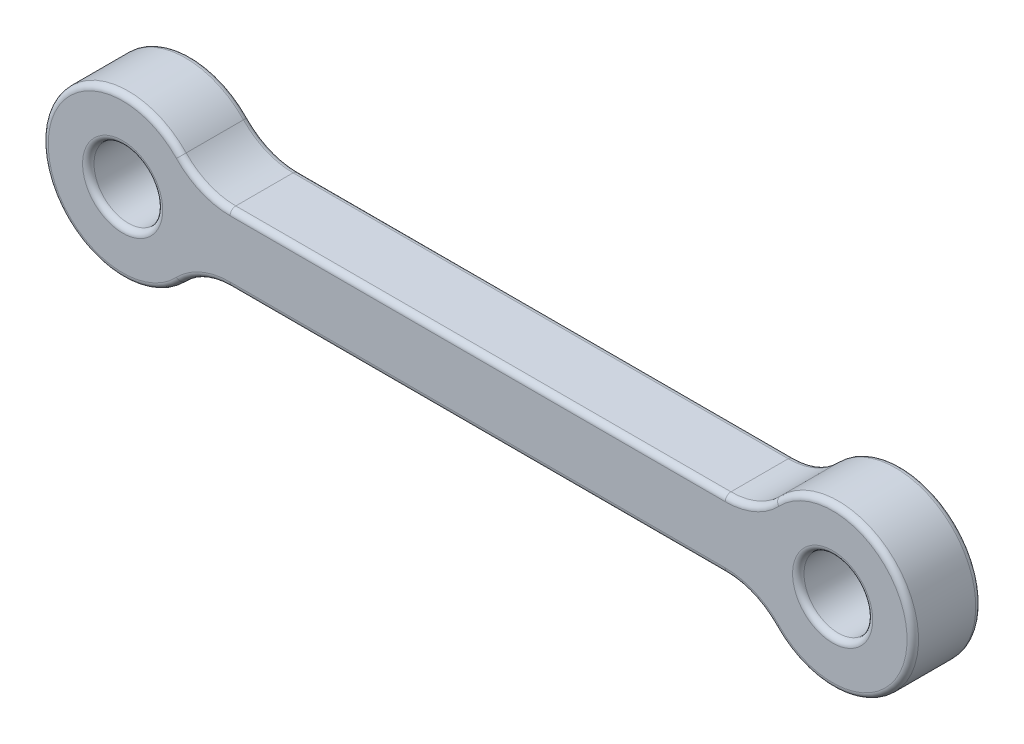
ISO-10303-21;
HEADER;
FILE_DESCRIPTION(('STEP AP214'),'2;1');
FILE_NAME('part.step','',(''),(''),'','','');
FILE_SCHEMA(('AUTOMOTIVE_DESIGN { 1 0 10303 214 1 1 1 1 }'));
ENDSEC;
DATA;
#1=APPLICATION_CONTEXT('core data for automotive mechanical design processes');
#2=APPLICATION_PROTOCOL_DEFINITION('international standard','automotive_design',2000,#1);
#3=PRODUCT_CONTEXT('',#1,'mechanical');
#4=PRODUCT('Part','Part','',(#3));
#5=PRODUCT_RELATED_PRODUCT_CATEGORY('part','',(#4));
#6=PRODUCT_DEFINITION_FORMATION('','',#4);
#7=PRODUCT_DEFINITION_CONTEXT('part definition',#1,'design');
#8=PRODUCT_DEFINITION('design','',#6,#7);
#9=PRODUCT_DEFINITION_SHAPE('','',#8);
#10=(LENGTH_UNIT() NAMED_UNIT(*) SI_UNIT(.MILLI.,.METRE.));
#11=(NAMED_UNIT(*) PLANE_ANGLE_UNIT() SI_UNIT($,.RADIAN.));
#12=(NAMED_UNIT(*) SI_UNIT($,.STERADIAN.) SOLID_ANGLE_UNIT());
#13=UNCERTAINTY_MEASURE_WITH_UNIT(LENGTH_MEASURE(1.E-05),#10,'distance_accuracy_value','');
#14=(GEOMETRIC_REPRESENTATION_CONTEXT(3) GLOBAL_UNCERTAINTY_ASSIGNED_CONTEXT((#13)) GLOBAL_UNIT_ASSIGNED_CONTEXT((#10,
#11,#12)) REPRESENTATION_CONTEXT('',''));
#15=CARTESIAN_POINT('',(0.,0.,0.));
#16=DIRECTION('',(0.,0.,1.));
#17=DIRECTION('',(1.,0.,0.));
#18=AXIS2_PLACEMENT_3D('',#15,#16,#17);
#19=CARTESIAN_POINT('',(0.,0.,1.5));
#20=DIRECTION('',(0.,0.,-1.));
#21=DIRECTION('',(-1.,0.,0.));
#22=AXIS2_PLACEMENT_3D('',#19,#20,#21);
#23=CYLINDRICAL_SURFACE('',#22,3.5);
#24=DIRECTION('',(0.,0.,-1.));
#25=VECTOR('',#24,1.);
#26=CARTESIAN_POINT('',(2.52560848605877,-2.42307692307692,1.5));
#27=LINE('',#26,#25);
#28=CARTESIAN_POINT('',(2.52560848605877,-2.42307692307692,-1.25));
#29=VERTEX_POINT('',#28);
#30=CARTESIAN_POINT('',(2.52560848605877,-2.42307692307692,1.25));
#31=VERTEX_POINT('',#30);
#32=EDGE_CURVE('E386',#29,#31,#27,.F.);
#33=ORIENTED_EDGE('',*,*,#32,.T.);
#34=CARTESIAN_POINT('',(0.,0.,1.25));
#35=DIRECTION('',(0.,0.,1.));
#36=DIRECTION('',(1.,0.,0.));
#37=AXIS2_PLACEMENT_3D('',#34,#35,#36);
#38=CIRCLE('',#37,3.5);
#39=CARTESIAN_POINT('',(2.52560848605877,2.42307692307692,1.25));
#40=VERTEX_POINT('',#39);
#41=EDGE_CURVE('E238',#31,#40,#38,.F.);
#42=ORIENTED_EDGE('',*,*,#41,.T.);
#43=DIRECTION('',(0.,0.,-1.));
#44=VECTOR('',#43,1.);
#45=CARTESIAN_POINT('',(2.52560848605877,2.42307692307692,1.5));
#46=LINE('',#45,#44);
#47=CARTESIAN_POINT('',(2.52560848605877,2.42307692307692,-1.25));
#48=VERTEX_POINT('',#47);
#49=EDGE_CURVE('E382',#40,#48,#46,.T.);
#50=ORIENTED_EDGE('',*,*,#49,.T.);
#51=CARTESIAN_POINT('',(0.,0.,-1.25));
#52=DIRECTION('',(0.,0.,1.));
#53=DIRECTION('',(1.,0.,0.));
#54=AXIS2_PLACEMENT_3D('',#51,#52,#53);
#55=CIRCLE('',#54,3.5);
#56=EDGE_CURVE('E235',#48,#29,#55,.T.);
#57=ORIENTED_EDGE('',*,*,#56,.T.);
#58=EDGE_LOOP('',(#33,#42,#50,#57));
#59=FACE_BOUND('',#58,.T.);
#60=ADVANCED_FACE('F41',(#59),#23,.T.);
#61=CARTESIAN_POINT('',(0.,-1.5,1.5));
#62=DIRECTION('',(0.,-1.,0.));
#63=DIRECTION('',(0.,0.,-1.));
#64=AXIS2_PLACEMENT_3D('',#61,#62,#63);
#65=PLANE('',#64);
#66=DIRECTION('',(0.,0.,1.));
#67=VECTOR('',#66,1.);
#68=CARTESIAN_POINT('',(26.3095842401766,-1.5,1.5));
#69=LINE('',#68,#67);
#70=CARTESIAN_POINT('',(26.3095842401766,-1.5,-1.25));
#71=VERTEX_POINT('',#70);
#72=CARTESIAN_POINT('',(26.3095842401766,-1.5,1.25));
#73=VERTEX_POINT('',#72);
#74=EDGE_CURVE('E378',#71,#73,#69,.T.);
#75=ORIENTED_EDGE('',*,*,#74,.T.);
#76=DIRECTION('',(-1.,0.,0.));
#77=VECTOR('',#76,1.);
#78=CARTESIAN_POINT('',(0.,-1.5,1.25));
#79=LINE('',#78,#77);
#80=CARTESIAN_POINT('',(4.69041575982343,-1.5,1.25));
#81=VERTEX_POINT('',#80);
#82=EDGE_CURVE('E225',#73,#81,#79,.T.);
#83=ORIENTED_EDGE('',*,*,#82,.T.);
#84=DIRECTION('',(0.,0.,-1.));
#85=VECTOR('',#84,1.);
#86=CARTESIAN_POINT('',(4.69041575982343,-1.5,1.5));
#87=LINE('',#86,#85);
#88=CARTESIAN_POINT('',(4.69041575982343,-1.5,-1.25));
#89=VERTEX_POINT('',#88);
#90=EDGE_CURVE('E374',#81,#89,#87,.T.);
#91=ORIENTED_EDGE('',*,*,#90,.T.);
#92=DIRECTION('',(-1.,0.,0.));
#93=VECTOR('',#92,1.);
#94=CARTESIAN_POINT('',(26.3095842401766,-1.5,-1.25));
#95=LINE('',#94,#93);
#96=EDGE_CURVE('E222',#89,#71,#95,.F.);
#97=ORIENTED_EDGE('',*,*,#96,.T.);
#98=EDGE_LOOP('',(#75,#83,#91,#97));
#99=FACE_BOUND('',#98,.T.);
#100=ADVANCED_FACE('F460',(#99),#65,.T.);
#101=CARTESIAN_POINT('',(31.,0.,1.5));
#102=DIRECTION('',(0.,0.,-1.));
#103=DIRECTION('',(-1.,0.,0.));
#104=AXIS2_PLACEMENT_3D('',#101,#102,#103);
#105=CYLINDRICAL_SURFACE('',#104,3.5);
#106=DIRECTION('',(0.,0.,-1.));
#107=VECTOR('',#106,1.);
#108=CARTESIAN_POINT('',(28.4743915139412,2.42307692307692,1.5));
#109=LINE('',#108,#107);
#110=CARTESIAN_POINT('',(28.4743915139412,2.42307692307692,-1.25));
#111=VERTEX_POINT('',#110);
#112=CARTESIAN_POINT('',(28.4743915139412,2.42307692307692,1.25));
#113=VERTEX_POINT('',#112);
#114=EDGE_CURVE('E358',#111,#113,#109,.F.);
#115=ORIENTED_EDGE('',*,*,#114,.T.);
#116=CARTESIAN_POINT('',(31.,0.,1.25));
#117=DIRECTION('',(0.,0.,1.));
#118=DIRECTION('',(1.,0.,0.));
#119=AXIS2_PLACEMENT_3D('',#116,#117,#118);
#120=CIRCLE('',#119,3.5);
#121=CARTESIAN_POINT('',(28.4743915139412,-2.42307692307692,1.25));
#122=VERTEX_POINT('',#121);
#123=EDGE_CURVE('E213',#113,#122,#120,.F.);
#124=ORIENTED_EDGE('',*,*,#123,.T.);
#125=DIRECTION('',(0.,0.,-1.));
#126=VECTOR('',#125,1.);
#127=CARTESIAN_POINT('',(28.4743915139412,-2.42307692307692,1.5));
#128=LINE('',#127,#126);
#129=CARTESIAN_POINT('',(28.4743915139412,-2.42307692307692,-1.25));
#130=VERTEX_POINT('',#129);
#131=EDGE_CURVE('E364',#122,#130,#128,.T.);
#132=ORIENTED_EDGE('',*,*,#131,.T.);
#133=CARTESIAN_POINT('',(31.,0.,-1.25));
#134=DIRECTION('',(0.,0.,1.));
#135=DIRECTION('',(1.,0.,0.));
#136=AXIS2_PLACEMENT_3D('',#133,#134,#135);
#137=CIRCLE('',#136,3.5);
#138=EDGE_CURVE('E210',#130,#111,#137,.T.);
#139=ORIENTED_EDGE('',*,*,#138,.T.);
#140=EDGE_LOOP('',(#115,#124,#132,#139));
#141=FACE_BOUND('',#140,.T.);
#142=ADVANCED_FACE('F416',(#141),#105,.T.);
#143=CARTESIAN_POINT('',(0.,1.5,1.5));
#144=DIRECTION('',(0.,-1.,0.));
#145=DIRECTION('',(0.,0.,-1.));
#146=AXIS2_PLACEMENT_3D('',#143,#144,#145);
#147=PLANE('',#146);
#148=DIRECTION('',(0.,0.,1.));
#149=VECTOR('',#148,1.);
#150=CARTESIAN_POINT('',(4.69041575982343,1.5,1.5));
#151=LINE('',#150,#149);
#152=CARTESIAN_POINT('',(4.69041575982343,1.5,-1.25));
#153=VERTEX_POINT('',#152);
#154=CARTESIAN_POINT('',(4.69041575982343,1.5,1.25));
#155=VERTEX_POINT('',#154);
#156=EDGE_CURVE('E310',#153,#155,#151,.T.);
#157=ORIENTED_EDGE('',*,*,#156,.T.);
#158=DIRECTION('',(-1.,0.,0.));
#159=VECTOR('',#158,1.);
#160=CARTESIAN_POINT('',(26.3095842401766,1.5,1.25));
#161=LINE('',#160,#159);
#162=CARTESIAN_POINT('',(26.3095842401766,1.5,1.25));
#163=VERTEX_POINT('',#162);
#164=EDGE_CURVE('E250',#155,#163,#161,.F.);
#165=ORIENTED_EDGE('',*,*,#164,.T.);
#166=DIRECTION('',(0.,0.,-1.));
#167=VECTOR('',#166,1.);
#168=CARTESIAN_POINT('',(26.3095842401766,1.5,1.5));
#169=LINE('',#168,#167);
#170=CARTESIAN_POINT('',(26.3095842401766,1.5,-1.25));
#171=VERTEX_POINT('',#170);
#172=EDGE_CURVE('E356',#163,#171,#169,.T.);
#173=ORIENTED_EDGE('',*,*,#172,.T.);
#174=DIRECTION('',(-1.,0.,0.));
#175=VECTOR('',#174,1.);
#176=CARTESIAN_POINT('',(0.,1.5,-1.25));
#177=LINE('',#176,#175);
#178=EDGE_CURVE('E247',#171,#153,#177,.T.);
#179=ORIENTED_EDGE('',*,*,#178,.T.);
#180=EDGE_LOOP('',(#157,#165,#173,#179));
#181=FACE_BOUND('',#180,.T.);
#182=ADVANCED_FACE('F361',(#181),#147,.F.);
#183=CARTESIAN_POINT('',(0.,0.,1.5));
#184=DIRECTION('',(0.,0.,-1.));
#185=DIRECTION('',(-1.,0.,0.));
#186=AXIS2_PLACEMENT_3D('',#183,#184,#185);
#187=CYLINDRICAL_SURFACE('',#186,1.5);
#188=CARTESIAN_POINT('',(0.,0.,1.25));
#189=DIRECTION('',(0.,0.,1.));
#190=DIRECTION('',(1.,0.,0.));
#191=AXIS2_PLACEMENT_3D('',#188,#189,#190);
#192=CIRCLE('',#191,1.5);
#193=CARTESIAN_POINT('',(1.5,0.,1.25));
#194=VERTEX_POINT('',#193);
#195=EDGE_CURVE('E257',#194,#194,#192,.T.);
#196=ORIENTED_EDGE('',*,*,#195,.T.);
#197=EDGE_LOOP('',(#196));
#198=FACE_BOUND('',#197,.T.);
#199=CARTESIAN_POINT('',(0.,0.,-1.25));
#200=DIRECTION('',(0.,0.,1.));
#201=DIRECTION('',(1.,0.,0.));
#202=AXIS2_PLACEMENT_3D('',#199,#200,#201);
#203=CIRCLE('',#202,1.5);
#204=CARTESIAN_POINT('',(1.5,0.,-1.25));
#205=VERTEX_POINT('',#204);
#206=EDGE_CURVE('E253',#205,#205,#203,.F.);
#207=ORIENTED_EDGE('',*,*,#206,.T.);
#208=EDGE_LOOP('',(#207));
#209=FACE_BOUND('',#208,.T.);
#210=ADVANCED_FACE('F471',(#198,#209),#187,.F.);
#211=CARTESIAN_POINT('',(31.,0.,1.5));
#212=DIRECTION('',(0.,0.,-1.));
#213=DIRECTION('',(-1.,0.,0.));
#214=AXIS2_PLACEMENT_3D('',#211,#212,#213);
#215=CYLINDRICAL_SURFACE('',#214,1.5);
#216=CARTESIAN_POINT('',(31.,0.,1.25));
#217=DIRECTION('',(0.,0.,1.));
#218=DIRECTION('',(1.,0.,0.));
#219=AXIS2_PLACEMENT_3D('',#216,#217,#218);
#220=CIRCLE('',#219,1.5);
#221=CARTESIAN_POINT('',(32.5,0.,1.25));
#222=VERTEX_POINT('',#221);
#223=EDGE_CURVE('E201',#222,#222,#220,.T.);
#224=ORIENTED_EDGE('',*,*,#223,.T.);
#225=EDGE_LOOP('',(#224));
#226=FACE_BOUND('',#225,.T.);
#227=CARTESIAN_POINT('',(31.,0.,-1.25));
#228=DIRECTION('',(0.,0.,1.));
#229=DIRECTION('',(1.,0.,0.));
#230=AXIS2_PLACEMENT_3D('',#227,#228,#229);
#231=CIRCLE('',#230,1.5);
#232=CARTESIAN_POINT('',(32.5,0.,-1.25));
#233=VERTEX_POINT('',#232);
#234=EDGE_CURVE('E192',#233,#233,#231,.F.);
#235=ORIENTED_EDGE('',*,*,#234,.T.);
#236=EDGE_LOOP('',(#235));
#237=FACE_BOUND('',#236,.T.);
#238=ADVANCED_FACE('F474',(#226,#237),#215,.F.);
#239=CARTESIAN_POINT('',(0.,0.,1.5));
#240=DIRECTION('',(0.,0.,1.));
#241=DIRECTION('',(1.,0.,0.));
#242=AXIS2_PLACEMENT_3D('',#239,#240,#241);
#243=PLANE('',#242);
#244=CARTESIAN_POINT('',(31.,0.,1.5));
#245=DIRECTION('',(0.,0.,1.));
#246=DIRECTION('',(1.,0.,0.));
#247=AXIS2_PLACEMENT_3D('',#244,#245,#246);
#248=CIRCLE('',#247,1.75);
#249=CARTESIAN_POINT('',(32.75,0.,1.5));
#250=VERTEX_POINT('',#249);
#251=EDGE_CURVE('E187',#250,#250,#248,.F.);
#252=ORIENTED_EDGE('',*,*,#251,.T.);
#253=EDGE_LOOP('',(#252));
#254=FACE_BOUND('',#253,.T.);
#255=CARTESIAN_POINT('',(31.,0.,1.5));
#256=DIRECTION('',(0.,0.,1.));
#257=DIRECTION('',(1.,0.,0.));
#258=AXIS2_PLACEMENT_3D('',#255,#256,#257);
#259=CIRCLE('',#258,3.25);
#260=CARTESIAN_POINT('',(28.6547921200883,-2.25,1.5));
#261=VERTEX_POINT('',#260);
#262=CARTESIAN_POINT('',(28.6547921200883,2.25,1.5));
#263=VERTEX_POINT('',#262);
#264=EDGE_CURVE('E184',#261,#263,#259,.T.);
#265=ORIENTED_EDGE('',*,*,#264,.T.);
#266=CARTESIAN_POINT('',(26.3095842401766,4.5,1.5));
#267=DIRECTION('',(0.,0.,1.));
#268=DIRECTION('',(1.,0.,0.));
#269=AXIS2_PLACEMENT_3D('',#266,#267,#268);
#270=CIRCLE('',#269,3.25);
#271=CARTESIAN_POINT('',(26.3095842401766,1.25,1.5));
#272=VERTEX_POINT('',#271);
#273=EDGE_CURVE('E162',#263,#272,#270,.F.);
#274=ORIENTED_EDGE('',*,*,#273,.T.);
#275=DIRECTION('',(-1.,0.,0.));
#276=VECTOR('',#275,1.);
#277=CARTESIAN_POINT('',(4.69041575982343,1.25,1.5));
#278=LINE('',#277,#276);
#279=CARTESIAN_POINT('',(4.69041575982343,1.25,1.5));
#280=VERTEX_POINT('',#279);
#281=EDGE_CURVE('E171',#272,#280,#278,.T.);
#282=ORIENTED_EDGE('',*,*,#281,.T.);
#283=CARTESIAN_POINT('',(4.69041575982343,4.5,1.5));
#284=DIRECTION('',(0.,0.,1.));
#285=DIRECTION('',(1.,0.,0.));
#286=AXIS2_PLACEMENT_3D('',#283,#284,#285);
#287=CIRCLE('',#286,3.25);
#288=CARTESIAN_POINT('',(2.34520787991171,2.25,1.5));
#289=VERTEX_POINT('',#288);
#290=EDGE_CURVE('E178',#280,#289,#287,.F.);
#291=ORIENTED_EDGE('',*,*,#290,.T.);
#292=CARTESIAN_POINT('',(0.,0.,1.5));
#293=DIRECTION('',(0.,0.,1.));
#294=DIRECTION('',(1.,0.,0.));
#295=AXIS2_PLACEMENT_3D('',#292,#293,#294);
#296=CIRCLE('',#295,3.25);
#297=CARTESIAN_POINT('',(2.34520787991171,-2.25,1.5));
#298=VERTEX_POINT('',#297);
#299=EDGE_CURVE('E395',#289,#298,#296,.T.);
#300=ORIENTED_EDGE('',*,*,#299,.T.);
#301=CARTESIAN_POINT('',(4.69041575982343,-4.5,1.5));
#302=DIRECTION('',(0.,0.,1.));
#303=DIRECTION('',(1.,0.,0.));
#304=AXIS2_PLACEMENT_3D('',#301,#302,#303);
#305=CIRCLE('',#304,3.25);
#306=CARTESIAN_POINT('',(4.69041575982343,-1.25,1.5));
#307=VERTEX_POINT('',#306);
#308=EDGE_CURVE('E398',#298,#307,#305,.F.);
#309=ORIENTED_EDGE('',*,*,#308,.T.);
#310=DIRECTION('',(-1.,0.,0.));
#311=VECTOR('',#310,1.);
#312=CARTESIAN_POINT('',(0.,-1.25,1.5));
#313=LINE('',#312,#311);
#314=CARTESIAN_POINT('',(26.3095842401766,-1.25,1.5));
#315=VERTEX_POINT('',#314);
#316=EDGE_CURVE('E401',#307,#315,#313,.F.);
#317=ORIENTED_EDGE('',*,*,#316,.T.);
#318=CARTESIAN_POINT('',(26.3095842401766,-4.5,1.5));
#319=DIRECTION('',(0.,0.,1.));
#320=DIRECTION('',(1.,0.,0.));
#321=AXIS2_PLACEMENT_3D('',#318,#319,#320);
#322=CIRCLE('',#321,3.25);
#323=EDGE_CURVE('E194',#315,#261,#322,.F.);
#324=ORIENTED_EDGE('',*,*,#323,.T.);
#325=EDGE_LOOP('',(#265,#274,#282,#291,#300,#309,#317,#324));
#326=FACE_BOUND('',#325,.T.);
#327=CARTESIAN_POINT('',(0.,0.,1.5));
#328=DIRECTION('',(0.,0.,1.));
#329=DIRECTION('',(1.,0.,0.));
#330=AXIS2_PLACEMENT_3D('',#327,#328,#329);
#331=CIRCLE('',#330,1.75);
#332=CARTESIAN_POINT('',(1.75,0.,1.5));
#333=VERTEX_POINT('',#332);
#334=EDGE_CURVE('E179',#333,#333,#331,.F.);
#335=ORIENTED_EDGE('',*,*,#334,.T.);
#336=EDGE_LOOP('',(#335));
#337=FACE_BOUND('',#336,.T.);
#338=ADVANCED_FACE('F181',(#254,#326,#337),#243,.T.);
#339=CARTESIAN_POINT('',(0.,0.,-1.5));
#340=DIRECTION('',(0.,0.,1.));
#341=DIRECTION('',(1.,0.,0.));
#342=AXIS2_PLACEMENT_3D('',#339,#340,#341);
#343=PLANE('',#342);
#344=CARTESIAN_POINT('',(31.,0.,-1.5));
#345=DIRECTION('',(0.,0.,1.));
#346=DIRECTION('',(1.,0.,0.));
#347=AXIS2_PLACEMENT_3D('',#344,#345,#346);
#348=CIRCLE('',#347,1.75);
#349=CARTESIAN_POINT('',(32.75,0.,-1.5));
#350=VERTEX_POINT('',#349);
#351=EDGE_CURVE('E11',#350,#350,#348,.T.);
#352=ORIENTED_EDGE('',*,*,#351,.T.);
#353=EDGE_LOOP('',(#352));
#354=FACE_BOUND('',#353,.T.);
#355=DIRECTION('',(-1.,0.,0.));
#356=VECTOR('',#355,1.);
#357=CARTESIAN_POINT('',(4.69041575982343,-1.25,-1.5));
#358=LINE('',#357,#356);
#359=CARTESIAN_POINT('',(26.3095842401766,-1.25,-1.5));
#360=VERTEX_POINT('',#359);
#361=CARTESIAN_POINT('',(4.69041575982343,-1.25,-1.5));
#362=VERTEX_POINT('',#361);
#363=EDGE_CURVE('E59',#360,#362,#358,.T.);
#364=ORIENTED_EDGE('',*,*,#363,.T.);
#365=CARTESIAN_POINT('',(4.69041575982343,-4.5,-1.5));
#366=DIRECTION('',(0.,0.,1.));
#367=DIRECTION('',(1.,0.,0.));
#368=AXIS2_PLACEMENT_3D('',#365,#366,#367);
#369=CIRCLE('',#368,3.25);
#370=CARTESIAN_POINT('',(2.34520787991171,-2.25,-1.5));
#371=VERTEX_POINT('',#370);
#372=EDGE_CURVE('E51',#362,#371,#369,.T.);
#373=ORIENTED_EDGE('',*,*,#372,.T.);
#374=CARTESIAN_POINT('',(0.,0.,-1.5));
#375=DIRECTION('',(0.,0.,1.));
#376=DIRECTION('',(1.,0.,0.));
#377=AXIS2_PLACEMENT_3D('',#374,#375,#376);
#378=CIRCLE('',#377,3.25);
#379=CARTESIAN_POINT('',(2.34520787991171,2.25,-1.5));
#380=VERTEX_POINT('',#379);
#381=EDGE_CURVE('E265',#371,#380,#378,.F.);
#382=ORIENTED_EDGE('',*,*,#381,.T.);
#383=CARTESIAN_POINT('',(4.69041575982343,4.5,-1.5));
#384=DIRECTION('',(0.,0.,1.));
#385=DIRECTION('',(1.,0.,0.));
#386=AXIS2_PLACEMENT_3D('',#383,#384,#385);
#387=CIRCLE('',#386,3.25);
#388=CARTESIAN_POINT('',(4.69041575982343,1.25,-1.5));
#389=VERTEX_POINT('',#388);
#390=EDGE_CURVE('E268',#380,#389,#387,.T.);
#391=ORIENTED_EDGE('',*,*,#390,.T.);
#392=DIRECTION('',(-1.,0.,0.));
#393=VECTOR('',#392,1.);
#394=CARTESIAN_POINT('',(0.,1.25,-1.5));
#395=LINE('',#394,#393);
#396=CARTESIAN_POINT('',(26.3095842401766,1.25,-1.5));
#397=VERTEX_POINT('',#396);
#398=EDGE_CURVE('E271',#389,#397,#395,.F.);
#399=ORIENTED_EDGE('',*,*,#398,.T.);
#400=CARTESIAN_POINT('',(26.3095842401766,4.5,-1.5));
#401=DIRECTION('',(0.,0.,1.));
#402=DIRECTION('',(1.,0.,0.));
#403=AXIS2_PLACEMENT_3D('',#400,#401,#402);
#404=CIRCLE('',#403,3.25);
#405=CARTESIAN_POINT('',(28.6547921200883,2.25,-1.5));
#406=VERTEX_POINT('',#405);
#407=EDGE_CURVE('E274',#397,#406,#404,.T.);
#408=ORIENTED_EDGE('',*,*,#407,.T.);
#409=CARTESIAN_POINT('',(31.,0.,-1.5));
#410=DIRECTION('',(0.,0.,1.));
#411=DIRECTION('',(1.,0.,0.));
#412=AXIS2_PLACEMENT_3D('',#409,#410,#411);
#413=CIRCLE('',#412,3.25);
#414=CARTESIAN_POINT('',(28.6547921200883,-2.25,-1.5));
#415=VERTEX_POINT('',#414);
#416=EDGE_CURVE('E277',#406,#415,#413,.F.);
#417=ORIENTED_EDGE('',*,*,#416,.T.);
#418=CARTESIAN_POINT('',(26.3095842401766,-4.5,-1.5));
#419=DIRECTION('',(0.,0.,1.));
#420=DIRECTION('',(1.,0.,0.));
#421=AXIS2_PLACEMENT_3D('',#418,#419,#420);
#422=CIRCLE('',#421,3.25);
#423=EDGE_CURVE('E64',#415,#360,#422,.T.);
#424=ORIENTED_EDGE('',*,*,#423,.T.);
#425=EDGE_LOOP('',(#364,#373,#382,#391,#399,#408,#417,#424));
#426=FACE_BOUND('',#425,.T.);
#427=CARTESIAN_POINT('',(0.,0.,-1.5));
#428=DIRECTION('',(0.,0.,1.));
#429=DIRECTION('',(1.,0.,0.));
#430=AXIS2_PLACEMENT_3D('',#427,#428,#429);
#431=CIRCLE('',#430,1.75);
#432=CARTESIAN_POINT('',(1.75,0.,-1.5));
#433=VERTEX_POINT('',#432);
#434=EDGE_CURVE('E261',#433,#433,#431,.T.);
#435=ORIENTED_EDGE('',*,*,#434,.T.);
#436=EDGE_LOOP('',(#435));
#437=FACE_BOUND('',#436,.T.);
#438=ADVANCED_FACE('F432',(#354,#426,#437),#343,.F.);
#439=CARTESIAN_POINT('',(26.3095842401766,4.5,1.5));
#440=DIRECTION('',(0.,0.,-1.));
#441=DIRECTION('',(-1.,0.,0.));
#442=AXIS2_PLACEMENT_3D('',#439,#440,#441);
#443=CYLINDRICAL_SURFACE('',#442,3.);
#444=ORIENTED_EDGE('',*,*,#172,.F.);
#445=CARTESIAN_POINT('',(26.3095842401766,4.5,1.25));
#446=DIRECTION('',(0.,0.,1.));
#447=DIRECTION('',(1.,0.,0.));
#448=AXIS2_PLACEMENT_3D('',#445,#446,#447);
#449=CIRCLE('',#448,3.);
#450=EDGE_CURVE('E164',#163,#113,#449,.T.);
#451=ORIENTED_EDGE('',*,*,#450,.T.);
#452=ORIENTED_EDGE('',*,*,#114,.F.);
#453=CARTESIAN_POINT('',(26.3095842401766,4.5,-1.25));
#454=DIRECTION('',(0.,0.,1.));
#455=DIRECTION('',(1.,0.,0.));
#456=AXIS2_PLACEMENT_3D('',#453,#454,#455);
#457=CIRCLE('',#456,3.);
#458=EDGE_CURVE('E205',#111,#171,#457,.F.);
#459=ORIENTED_EDGE('',*,*,#458,.T.);
#460=EDGE_LOOP('',(#444,#451,#452,#459));
#461=FACE_BOUND('',#460,.T.);
#462=ADVANCED_FACE('F355',(#461),#443,.F.);
#463=CARTESIAN_POINT('',(26.3095842401766,-4.5,1.5));
#464=DIRECTION('',(0.,0.,-1.));
#465=DIRECTION('',(-1.,0.,0.));
#466=AXIS2_PLACEMENT_3D('',#463,#464,#465);
#467=CYLINDRICAL_SURFACE('',#466,3.);
#468=ORIENTED_EDGE('',*,*,#131,.F.);
#469=CARTESIAN_POINT('',(26.3095842401766,-4.5,1.25));
#470=DIRECTION('',(0.,0.,1.));
#471=DIRECTION('',(1.,0.,0.));
#472=AXIS2_PLACEMENT_3D('',#469,#470,#471);
#473=CIRCLE('',#472,3.);
#474=EDGE_CURVE('E219',#122,#73,#473,.T.);
#475=ORIENTED_EDGE('',*,*,#474,.T.);
#476=ORIENTED_EDGE('',*,*,#74,.F.);
#477=CARTESIAN_POINT('',(26.3095842401766,-4.5,-1.25));
#478=DIRECTION('',(0.,0.,1.));
#479=DIRECTION('',(1.,0.,0.));
#480=AXIS2_PLACEMENT_3D('',#477,#478,#479);
#481=CIRCLE('',#480,3.);
#482=EDGE_CURVE('E216',#71,#130,#481,.F.);
#483=ORIENTED_EDGE('',*,*,#482,.T.);
#484=EDGE_LOOP('',(#468,#475,#476,#483));
#485=FACE_BOUND('',#484,.T.);
#486=ADVANCED_FACE('F418',(#485),#467,.F.);
#487=CARTESIAN_POINT('',(4.69041575982343,-4.5,1.5));
#488=DIRECTION('',(0.,0.,-1.));
#489=DIRECTION('',(-1.,0.,0.));
#490=AXIS2_PLACEMENT_3D('',#487,#488,#489);
#491=CYLINDRICAL_SURFACE('',#490,3.);
#492=ORIENTED_EDGE('',*,*,#90,.F.);
#493=CARTESIAN_POINT('',(4.69041575982343,-4.5,1.25));
#494=DIRECTION('',(0.,0.,1.));
#495=DIRECTION('',(1.,0.,0.));
#496=AXIS2_PLACEMENT_3D('',#493,#494,#495);
#497=CIRCLE('',#496,3.);
#498=EDGE_CURVE('E232',#81,#31,#497,.T.);
#499=ORIENTED_EDGE('',*,*,#498,.T.);
#500=ORIENTED_EDGE('',*,*,#32,.F.);
#501=CARTESIAN_POINT('',(4.69041575982343,-4.5,-1.25));
#502=DIRECTION('',(0.,0.,1.));
#503=DIRECTION('',(1.,0.,0.));
#504=AXIS2_PLACEMENT_3D('',#501,#502,#503);
#505=CIRCLE('',#504,3.);
#506=EDGE_CURVE('E228',#29,#89,#505,.F.);
#507=ORIENTED_EDGE('',*,*,#506,.T.);
#508=EDGE_LOOP('',(#492,#499,#500,#507));
#509=FACE_BOUND('',#508,.T.);
#510=ADVANCED_FACE('F449',(#509),#491,.F.);
#511=CARTESIAN_POINT('',(4.69041575982343,4.5,1.5));
#512=DIRECTION('',(0.,0.,-1.));
#513=DIRECTION('',(-1.,0.,0.));
#514=AXIS2_PLACEMENT_3D('',#511,#512,#513);
#515=CYLINDRICAL_SURFACE('',#514,3.);
#516=ORIENTED_EDGE('',*,*,#49,.F.);
#517=CARTESIAN_POINT('',(4.69041575982343,4.5,1.25));
#518=DIRECTION('',(0.,0.,1.));
#519=DIRECTION('',(1.,0.,0.));
#520=AXIS2_PLACEMENT_3D('',#517,#518,#519);
#521=CIRCLE('',#520,3.);
#522=EDGE_CURVE('E244',#40,#155,#521,.T.);
#523=ORIENTED_EDGE('',*,*,#522,.T.);
#524=ORIENTED_EDGE('',*,*,#156,.F.);
#525=CARTESIAN_POINT('',(4.69041575982343,4.5,-1.25));
#526=DIRECTION('',(0.,0.,1.));
#527=DIRECTION('',(1.,0.,0.));
#528=AXIS2_PLACEMENT_3D('',#525,#526,#527);
#529=CIRCLE('',#528,3.);
#530=EDGE_CURVE('E241',#153,#48,#529,.F.);
#531=ORIENTED_EDGE('',*,*,#530,.T.);
#532=EDGE_LOOP('',(#516,#523,#524,#531));
#533=FACE_BOUND('',#532,.T.);
#534=ADVANCED_FACE('F482',(#533),#515,.F.);
#535=CARTESIAN_POINT('',(31.,0.,1.25));
#536=DIRECTION('',(0.,0.,1.));
#537=DIRECTION('',(1.,0.,0.));
#538=AXIS2_PLACEMENT_3D('',#535,#536,#537);
#539=TOROIDAL_SURFACE('',#538,1.75,0.25);
#540=ORIENTED_EDGE('',*,*,#223,.F.);
#541=EDGE_LOOP('',(#540));
#542=FACE_BOUND('',#541,.T.);
#543=ORIENTED_EDGE('',*,*,#251,.F.);
#544=EDGE_LOOP('',(#543));
#545=FACE_BOUND('',#544,.T.);
#546=ADVANCED_FACE('F485',(#542,#545),#539,.T.);
#547=CARTESIAN_POINT('',(4.69041575982343,-4.5,1.25));
#548=DIRECTION('',(0.,0.,1.));
#549=DIRECTION('',(1.,0.,0.));
#550=AXIS2_PLACEMENT_3D('',#547,#548,#549);
#551=TOROIDAL_SURFACE('',#550,3.25,0.25);
#552=CARTESIAN_POINT('',(2.34520787991171,-2.25,1.25));
#553=DIRECTION('',(-0.692307692307692,-0.72160242458822,0.));
#554=DIRECTION('',(0.72160242458822,-0.692307692307692,0.));
#555=AXIS2_PLACEMENT_3D('',#552,#553,#554);
#556=CIRCLE('',#555,0.25);
#557=EDGE_CURVE('E302',#31,#298,#556,.T.);
#558=ORIENTED_EDGE('',*,*,#557,.F.);
#559=ORIENTED_EDGE('',*,*,#498,.F.);
#560=CARTESIAN_POINT('',(4.69041575982343,-1.25,1.25));
#561=DIRECTION('',(1.,0.,0.));
#562=DIRECTION('',(0.,0.,-1.));
#563=AXIS2_PLACEMENT_3D('',#560,#561,#562);
#564=CIRCLE('',#563,0.25);
#565=EDGE_CURVE('E306',#307,#81,#564,.T.);
#566=ORIENTED_EDGE('',*,*,#565,.F.);
#567=ORIENTED_EDGE('',*,*,#308,.F.);
#568=EDGE_LOOP('',(#558,#559,#566,#567));
#569=FACE_BOUND('',#568,.T.);
#570=ADVANCED_FACE('F453',(#569),#551,.T.);
#571=CARTESIAN_POINT('',(0.,-1.25,1.25));
#572=DIRECTION('',(-1.,0.,0.));
#573=DIRECTION('',(0.,0.,1.));
#574=AXIS2_PLACEMENT_3D('',#571,#572,#573);
#575=CYLINDRICAL_SURFACE('',#574,0.25);
#576=ORIENTED_EDGE('',*,*,#565,.T.);
#577=ORIENTED_EDGE('',*,*,#82,.F.);
#578=CARTESIAN_POINT('',(26.3095842401766,-1.25,1.25));
#579=DIRECTION('',(1.,0.,0.));
#580=DIRECTION('',(0.,0.,-1.));
#581=AXIS2_PLACEMENT_3D('',#578,#579,#580);
#582=CIRCLE('',#581,0.25);
#583=EDGE_CURVE('E298',#315,#73,#582,.T.);
#584=ORIENTED_EDGE('',*,*,#583,.F.);
#585=ORIENTED_EDGE('',*,*,#316,.F.);
#586=EDGE_LOOP('',(#576,#577,#584,#585));
#587=FACE_BOUND('',#586,.T.);
#588=ADVANCED_FACE('F458',(#587),#575,.T.);
#589=CARTESIAN_POINT('',(0.,0.,1.25));
#590=DIRECTION('',(0.,0.,1.));
#591=DIRECTION('',(1.,0.,0.));
#592=AXIS2_PLACEMENT_3D('',#589,#590,#591);
#593=TOROIDAL_SURFACE('',#592,3.25,0.25);
#594=ORIENTED_EDGE('',*,*,#557,.T.);
#595=ORIENTED_EDGE('',*,*,#299,.F.);
#596=CARTESIAN_POINT('',(2.34520787991171,2.25,1.25));
#597=DIRECTION('',(0.692307692307692,-0.72160242458822,0.));
#598=DIRECTION('',(0.72160242458822,0.692307692307692,0.));
#599=AXIS2_PLACEMENT_3D('',#596,#597,#598);
#600=CIRCLE('',#599,0.25);
#601=EDGE_CURVE('E294',#40,#289,#600,.T.);
#602=ORIENTED_EDGE('',*,*,#601,.F.);
#603=ORIENTED_EDGE('',*,*,#41,.F.);
#604=EDGE_LOOP('',(#594,#595,#602,#603));
#605=FACE_BOUND('',#604,.T.);
#606=ADVANCED_FACE('F503',(#605),#593,.T.);
#607=CARTESIAN_POINT('',(26.3095842401766,-4.5,1.25));
#608=DIRECTION('',(0.,0.,1.));
#609=DIRECTION('',(1.,0.,0.));
#610=AXIS2_PLACEMENT_3D('',#607,#608,#609);
#611=TOROIDAL_SURFACE('',#610,3.25,0.25);
#612=ORIENTED_EDGE('',*,*,#583,.T.);
#613=ORIENTED_EDGE('',*,*,#474,.F.);
#614=CARTESIAN_POINT('',(28.6547921200883,-2.25,1.25));
#615=DIRECTION('',(0.692307692307699,-0.721602424588214,0.));
#616=DIRECTION('',(0.721602424588214,0.692307692307699,0.));
#617=AXIS2_PLACEMENT_3D('',#614,#615,#616);
#618=CIRCLE('',#617,0.25);
#619=EDGE_CURVE('E290',#261,#122,#618,.T.);
#620=ORIENTED_EDGE('',*,*,#619,.F.);
#621=ORIENTED_EDGE('',*,*,#323,.F.);
#622=EDGE_LOOP('',(#612,#613,#620,#621));
#623=FACE_BOUND('',#622,.T.);
#624=ADVANCED_FACE('F410',(#623),#611,.T.);
#625=CARTESIAN_POINT('',(4.69041575982343,4.5,1.25));
#626=DIRECTION('',(0.,0.,1.));
#627=DIRECTION('',(1.,0.,0.));
#628=AXIS2_PLACEMENT_3D('',#625,#626,#627);
#629=TOROIDAL_SURFACE('',#628,3.25,0.25);
#630=ORIENTED_EDGE('',*,*,#601,.T.);
#631=ORIENTED_EDGE('',*,*,#290,.F.);
#632=CARTESIAN_POINT('',(4.69041575982343,1.25,1.25));
#633=DIRECTION('',(1.,0.,0.));
#634=DIRECTION('',(0.,0.,-1.));
#635=AXIS2_PLACEMENT_3D('',#632,#633,#634);
#636=CIRCLE('',#635,0.25);
#637=EDGE_CURVE('E174',#155,#280,#636,.T.);
#638=ORIENTED_EDGE('',*,*,#637,.F.);
#639=ORIENTED_EDGE('',*,*,#522,.F.);
#640=EDGE_LOOP('',(#630,#631,#638,#639));
#641=FACE_BOUND('',#640,.T.);
#642=ADVANCED_FACE('F497',(#641),#629,.T.);
#643=CARTESIAN_POINT('',(31.,0.,1.25));
#644=DIRECTION('',(0.,0.,1.));
#645=DIRECTION('',(1.,0.,0.));
#646=AXIS2_PLACEMENT_3D('',#643,#644,#645);
#647=TOROIDAL_SURFACE('',#646,3.25,0.25);
#648=ORIENTED_EDGE('',*,*,#619,.T.);
#649=ORIENTED_EDGE('',*,*,#123,.F.);
#650=CARTESIAN_POINT('',(28.6547921200883,2.25,1.25));
#651=DIRECTION('',(-0.692307692307698,-0.721602424588214,0.));
#652=DIRECTION('',(0.721602424588215,-0.692307692307698,0.));
#653=AXIS2_PLACEMENT_3D('',#650,#651,#652);
#654=CIRCLE('',#653,0.25);
#655=EDGE_CURVE('E168',#263,#113,#654,.T.);
#656=ORIENTED_EDGE('',*,*,#655,.F.);
#657=ORIENTED_EDGE('',*,*,#264,.F.);
#658=EDGE_LOOP('',(#648,#649,#656,#657));
#659=FACE_BOUND('',#658,.T.);
#660=ADVANCED_FACE('F413',(#659),#647,.T.);
#661=CARTESIAN_POINT('',(0.,1.25,1.25));
#662=DIRECTION('',(1.,0.,0.));
#663=DIRECTION('',(0.,0.,-1.));
#664=AXIS2_PLACEMENT_3D('',#661,#662,#663);
#665=CYLINDRICAL_SURFACE('',#664,0.25);
#666=ORIENTED_EDGE('',*,*,#637,.T.);
#667=ORIENTED_EDGE('',*,*,#281,.F.);
#668=CARTESIAN_POINT('',(26.3095842401766,1.25,1.25));
#669=DIRECTION('',(1.,0.,0.));
#670=DIRECTION('',(0.,0.,-1.));
#671=AXIS2_PLACEMENT_3D('',#668,#669,#670);
#672=CIRCLE('',#671,0.25);
#673=EDGE_CURVE('E158',#163,#272,#672,.T.);
#674=ORIENTED_EDGE('',*,*,#673,.F.);
#675=ORIENTED_EDGE('',*,*,#164,.F.);
#676=EDGE_LOOP('',(#666,#667,#674,#675));
#677=FACE_BOUND('',#676,.T.);
#678=ADVANCED_FACE('F172',(#677),#665,.T.);
#679=CARTESIAN_POINT('',(26.3095842401766,4.5,1.25));
#680=DIRECTION('',(0.,0.,1.));
#681=DIRECTION('',(1.,0.,0.));
#682=AXIS2_PLACEMENT_3D('',#679,#680,#681);
#683=TOROIDAL_SURFACE('',#682,3.25,0.25);
#684=ORIENTED_EDGE('',*,*,#655,.T.);
#685=ORIENTED_EDGE('',*,*,#450,.F.);
#686=ORIENTED_EDGE('',*,*,#673,.T.);
#687=ORIENTED_EDGE('',*,*,#273,.F.);
#688=EDGE_LOOP('',(#684,#685,#686,#687));
#689=FACE_BOUND('',#688,.T.);
#690=ADVANCED_FACE('F160',(#689),#683,.T.);
#691=CARTESIAN_POINT('',(0.,0.,1.25));
#692=DIRECTION('',(0.,0.,1.));
#693=DIRECTION('',(1.,0.,0.));
#694=AXIS2_PLACEMENT_3D('',#691,#692,#693);
#695=TOROIDAL_SURFACE('',#694,1.75,0.25);
#696=ORIENTED_EDGE('',*,*,#334,.F.);
#697=EDGE_LOOP('',(#696));
#698=FACE_BOUND('',#697,.T.);
#699=ORIENTED_EDGE('',*,*,#195,.F.);
#700=EDGE_LOOP('',(#699));
#701=FACE_BOUND('',#700,.T.);
#702=ADVANCED_FACE('F492',(#698,#701),#695,.T.);
#703=CARTESIAN_POINT('',(31.,0.,-1.25));
#704=DIRECTION('',(0.,0.,1.));
#705=DIRECTION('',(1.,0.,0.));
#706=AXIS2_PLACEMENT_3D('',#703,#704,#705);
#707=TOROIDAL_SURFACE('',#706,1.75,0.25);
#708=ORIENTED_EDGE('',*,*,#351,.F.);
#709=EDGE_LOOP('',(#708));
#710=FACE_BOUND('',#709,.T.);
#711=ORIENTED_EDGE('',*,*,#234,.F.);
#712=EDGE_LOOP('',(#711));
#713=FACE_BOUND('',#712,.T.);
#714=ADVANCED_FACE('F513',(#710,#713),#707,.T.);
#715=CARTESIAN_POINT('',(26.3095842401766,4.5,-1.25));
#716=DIRECTION('',(0.,0.,1.));
#717=DIRECTION('',(1.,0.,0.));
#718=AXIS2_PLACEMENT_3D('',#715,#716,#717);
#719=TOROIDAL_SURFACE('',#718,3.25,0.25);
#720=CARTESIAN_POINT('',(26.3095842401766,1.25,-1.25));
#721=DIRECTION('',(-1.,0.,0.));
#722=DIRECTION('',(0.,0.,1.));
#723=AXIS2_PLACEMENT_3D('',#720,#721,#722);
#724=CIRCLE('',#723,0.25);
#725=EDGE_CURVE('E332',#171,#397,#724,.T.);
#726=ORIENTED_EDGE('',*,*,#725,.F.);
#727=ORIENTED_EDGE('',*,*,#458,.F.);
#728=CARTESIAN_POINT('',(28.6547921200883,2.25,-1.25));
#729=DIRECTION('',(0.692307692307699,0.721602424588214,0.));
#730=DIRECTION('',(-0.721602424588214,0.692307692307699,0.));
#731=AXIS2_PLACEMENT_3D('',#728,#729,#730);
#732=CIRCLE('',#731,0.25);
#733=EDGE_CURVE('E45',#406,#111,#732,.T.);
#734=ORIENTED_EDGE('',*,*,#733,.F.);
#735=ORIENTED_EDGE('',*,*,#407,.F.);
#736=EDGE_LOOP('',(#726,#727,#734,#735));
#737=FACE_BOUND('',#736,.T.);
#738=ADVANCED_FACE('F350',(#737),#719,.T.);
#739=CARTESIAN_POINT('',(31.,0.,-1.25));
#740=DIRECTION('',(0.,0.,1.));
#741=DIRECTION('',(1.,0.,0.));
#742=AXIS2_PLACEMENT_3D('',#739,#740,#741);
#743=TOROIDAL_SURFACE('',#742,3.25,0.25);
#744=ORIENTED_EDGE('',*,*,#733,.T.);
#745=ORIENTED_EDGE('',*,*,#138,.F.);
#746=CARTESIAN_POINT('',(28.6547921200883,-2.25,-1.25));
#747=DIRECTION('',(-0.692307692307698,0.721602424588214,0.));
#748=DIRECTION('',(-0.721602424588215,-0.692307692307698,0.));
#749=AXIS2_PLACEMENT_3D('',#746,#747,#748);
#750=CIRCLE('',#749,0.25);
#751=EDGE_CURVE('E329',#415,#130,#750,.T.);
#752=ORIENTED_EDGE('',*,*,#751,.F.);
#753=ORIENTED_EDGE('',*,*,#416,.F.);
#754=EDGE_LOOP('',(#744,#745,#752,#753));
#755=FACE_BOUND('',#754,.T.);
#756=ADVANCED_FACE('F345',(#755),#743,.T.);
#757=CARTESIAN_POINT('',(0.,1.25,-1.25));
#758=DIRECTION('',(-1.,0.,0.));
#759=DIRECTION('',(0.,0.,1.));
#760=AXIS2_PLACEMENT_3D('',#757,#758,#759);
#761=CYLINDRICAL_SURFACE('',#760,0.25);
#762=ORIENTED_EDGE('',*,*,#725,.T.);
#763=ORIENTED_EDGE('',*,*,#398,.F.);
#764=CARTESIAN_POINT('',(4.69041575982343,1.25,-1.25));
#765=DIRECTION('',(-1.,0.,0.));
#766=DIRECTION('',(0.,0.,1.));
#767=AXIS2_PLACEMENT_3D('',#764,#765,#766);
#768=CIRCLE('',#767,0.25);
#769=EDGE_CURVE('E325',#153,#389,#768,.T.);
#770=ORIENTED_EDGE('',*,*,#769,.F.);
#771=ORIENTED_EDGE('',*,*,#178,.F.);
#772=EDGE_LOOP('',(#762,#763,#770,#771));
#773=FACE_BOUND('',#772,.T.);
#774=ADVANCED_FACE('F528',(#773),#761,.T.);
#775=CARTESIAN_POINT('',(26.3095842401766,-4.5,-1.25));
#776=DIRECTION('',(0.,0.,1.));
#777=DIRECTION('',(1.,0.,0.));
#778=AXIS2_PLACEMENT_3D('',#775,#776,#777);
#779=TOROIDAL_SURFACE('',#778,3.25,0.25);
#780=ORIENTED_EDGE('',*,*,#751,.T.);
#781=ORIENTED_EDGE('',*,*,#482,.F.);
#782=CARTESIAN_POINT('',(26.3095842401766,-1.25,-1.25));
#783=DIRECTION('',(-1.,0.,0.));
#784=DIRECTION('',(0.,0.,1.));
#785=AXIS2_PLACEMENT_3D('',#782,#783,#784);
#786=CIRCLE('',#785,0.25);
#787=EDGE_CURVE('E321',#360,#71,#786,.T.);
#788=ORIENTED_EDGE('',*,*,#787,.F.);
#789=ORIENTED_EDGE('',*,*,#423,.F.);
#790=EDGE_LOOP('',(#780,#781,#788,#789));
#791=FACE_BOUND('',#790,.T.);
#792=ADVANCED_FACE('F422',(#791),#779,.T.);
#793=CARTESIAN_POINT('',(4.69041575982343,4.5,-1.25));
#794=DIRECTION('',(0.,0.,1.));
#795=DIRECTION('',(1.,0.,0.));
#796=AXIS2_PLACEMENT_3D('',#793,#794,#795);
#797=TOROIDAL_SURFACE('',#796,3.25,0.25);
#798=ORIENTED_EDGE('',*,*,#769,.T.);
#799=ORIENTED_EDGE('',*,*,#390,.F.);
#800=CARTESIAN_POINT('',(2.34520787991171,2.25,-1.25));
#801=DIRECTION('',(-0.692307692307692,0.721602424588221,0.));
#802=DIRECTION('',(-0.721602424588221,-0.692307692307692,0.));
#803=AXIS2_PLACEMENT_3D('',#800,#801,#802);
#804=CIRCLE('',#803,0.25);
#805=EDGE_CURVE('E317',#48,#380,#804,.T.);
#806=ORIENTED_EDGE('',*,*,#805,.F.);
#807=ORIENTED_EDGE('',*,*,#530,.F.);
#808=EDGE_LOOP('',(#798,#799,#806,#807));
#809=FACE_BOUND('',#808,.T.);
#810=ADVANCED_FACE('F438',(#809),#797,.T.);
#811=CARTESIAN_POINT('',(0.,-1.25,-1.25));
#812=DIRECTION('',(1.,0.,0.));
#813=DIRECTION('',(0.,0.,-1.));
#814=AXIS2_PLACEMENT_3D('',#811,#812,#813);
#815=CYLINDRICAL_SURFACE('',#814,0.25);
#816=ORIENTED_EDGE('',*,*,#787,.T.);
#817=ORIENTED_EDGE('',*,*,#96,.F.);
#818=CARTESIAN_POINT('',(4.69041575982343,-1.25,-1.25));
#819=DIRECTION('',(-1.,0.,0.));
#820=DIRECTION('',(0.,0.,1.));
#821=AXIS2_PLACEMENT_3D('',#818,#819,#820);
#822=CIRCLE('',#821,0.25);
#823=EDGE_CURVE('E314',#362,#89,#822,.T.);
#824=ORIENTED_EDGE('',*,*,#823,.F.);
#825=ORIENTED_EDGE('',*,*,#363,.F.);
#826=EDGE_LOOP('',(#816,#817,#824,#825));
#827=FACE_BOUND('',#826,.T.);
#828=ADVANCED_FACE('F425',(#827),#815,.T.);
#829=CARTESIAN_POINT('',(0.,0.,-1.25));
#830=DIRECTION('',(0.,0.,1.));
#831=DIRECTION('',(1.,0.,0.));
#832=AXIS2_PLACEMENT_3D('',#829,#830,#831);
#833=TOROIDAL_SURFACE('',#832,3.25,0.25);
#834=ORIENTED_EDGE('',*,*,#805,.T.);
#835=ORIENTED_EDGE('',*,*,#381,.F.);
#836=CARTESIAN_POINT('',(2.34520787991171,-2.25,-1.25));
#837=DIRECTION('',(0.692307692307692,0.721602424588221,0.));
#838=DIRECTION('',(-0.721602424588221,0.692307692307692,0.));
#839=AXIS2_PLACEMENT_3D('',#836,#837,#838);
#840=CIRCLE('',#839,0.25);
#841=EDGE_CURVE('E311',#29,#371,#840,.T.);
#842=ORIENTED_EDGE('',*,*,#841,.F.);
#843=ORIENTED_EDGE('',*,*,#56,.F.);
#844=EDGE_LOOP('',(#834,#835,#842,#843));
#845=FACE_BOUND('',#844,.T.);
#846=ADVANCED_FACE('F442',(#845),#833,.T.);
#847=CARTESIAN_POINT('',(4.69041575982343,-4.5,-1.25));
#848=DIRECTION('',(0.,0.,1.));
#849=DIRECTION('',(1.,0.,0.));
#850=AXIS2_PLACEMENT_3D('',#847,#848,#849);
#851=TOROIDAL_SURFACE('',#850,3.25,0.25);
#852=ORIENTED_EDGE('',*,*,#823,.T.);
#853=ORIENTED_EDGE('',*,*,#506,.F.);
#854=ORIENTED_EDGE('',*,*,#841,.T.);
#855=ORIENTED_EDGE('',*,*,#372,.F.);
#856=EDGE_LOOP('',(#852,#853,#854,#855));
#857=FACE_BOUND('',#856,.T.);
#858=ADVANCED_FACE('F429',(#857),#851,.T.);
#859=CARTESIAN_POINT('',(0.,0.,-1.25));
#860=DIRECTION('',(0.,0.,1.));
#861=DIRECTION('',(1.,0.,0.));
#862=AXIS2_PLACEMENT_3D('',#859,#860,#861);
#863=TOROIDAL_SURFACE('',#862,1.75,0.25);
#864=ORIENTED_EDGE('',*,*,#206,.F.);
#865=EDGE_LOOP('',(#864));
#866=FACE_BOUND('',#865,.T.);
#867=ORIENTED_EDGE('',*,*,#434,.F.);
#868=EDGE_LOOP('',(#867));
#869=FACE_BOUND('',#868,.T.);
#870=ADVANCED_FACE('F43',(#866,#869),#863,.T.);
#871=CLOSED_SHELL('',(#60,#100,#142,#182,#210,#238,#338,#438,#462,#486,#510,#534,#546,#570,#588,
#606,#624,#642,#660,#678,#690,#702,#714,#738,#756,#774,#792,#810,#828,#846,#858,#870));
#872=MANIFOLD_SOLID_BREP('B2',#871);
#873=ADVANCED_BREP_SHAPE_REPRESENTATION('',(#18,#872),#14);
#874=SHAPE_DEFINITION_REPRESENTATION(#9,#873);
ENDSEC;
END-ISO-10303-21;
